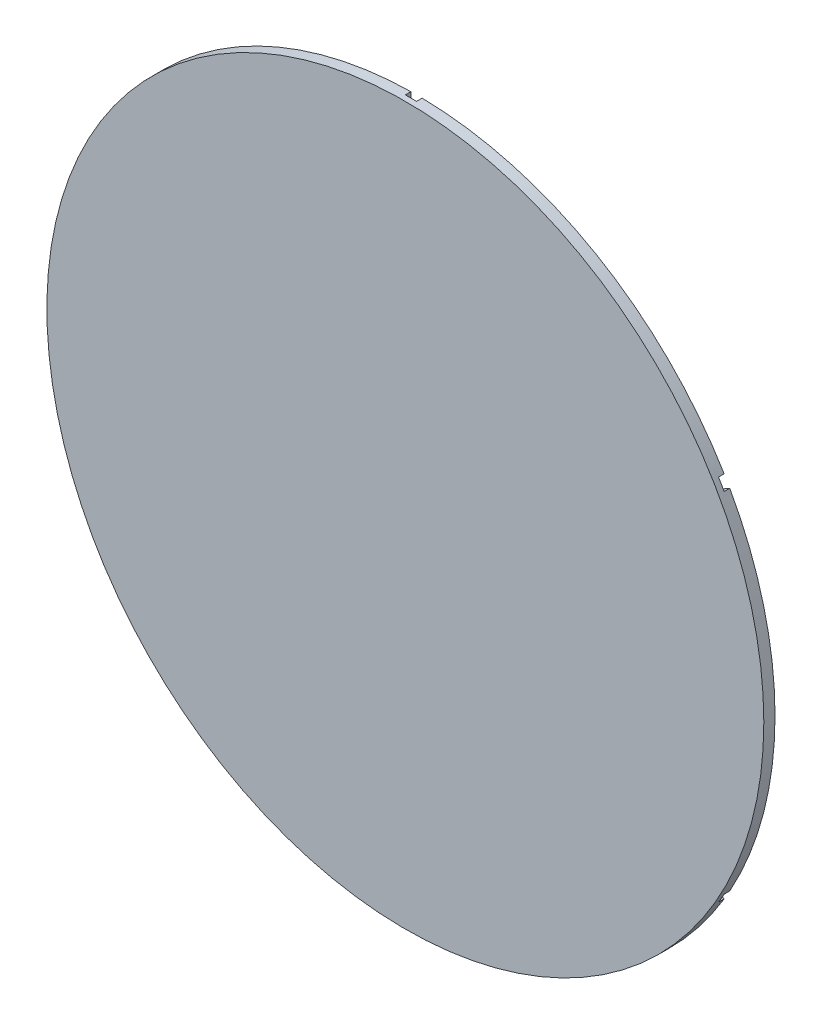
ISO-10303-21;
HEADER;
FILE_DESCRIPTION(('STEP AP214'),'2;1');
FILE_NAME('part.step','',(''),(''),'','','');
FILE_SCHEMA(('AUTOMOTIVE_DESIGN { 1 0 10303 214 1 1 1 1 }'));
ENDSEC;
DATA;
#1=APPLICATION_CONTEXT('core data for automotive mechanical design processes');
#2=APPLICATION_PROTOCOL_DEFINITION('international standard','automotive_design',2000,#1);
#3=PRODUCT_CONTEXT('',#1,'mechanical');
#4=PRODUCT('Part','Part','',(#3));
#5=PRODUCT_RELATED_PRODUCT_CATEGORY('part','',(#4));
#6=PRODUCT_DEFINITION_FORMATION('','',#4);
#7=PRODUCT_DEFINITION_CONTEXT('part definition',#1,'design');
#8=PRODUCT_DEFINITION('design','',#6,#7);
#9=PRODUCT_DEFINITION_SHAPE('','',#8);
#10=(LENGTH_UNIT() NAMED_UNIT(*) SI_UNIT(.MILLI.,.METRE.));
#11=(NAMED_UNIT(*) PLANE_ANGLE_UNIT() SI_UNIT($,.RADIAN.));
#12=(NAMED_UNIT(*) SI_UNIT($,.STERADIAN.) SOLID_ANGLE_UNIT());
#13=UNCERTAINTY_MEASURE_WITH_UNIT(LENGTH_MEASURE(1.E-05),#10,'distance_accuracy_value','');
#14=(GEOMETRIC_REPRESENTATION_CONTEXT(3) GLOBAL_UNCERTAINTY_ASSIGNED_CONTEXT((#13)) GLOBAL_UNIT_ASSIGNED_CONTEXT((#10,
#11,#12)) REPRESENTATION_CONTEXT('',''));
#15=CARTESIAN_POINT('',(0.,0.,0.));
#16=DIRECTION('',(0.,0.,1.));
#17=DIRECTION('',(1.,0.,0.));
#18=AXIS2_PLACEMENT_3D('',#15,#16,#17);
#19=CARTESIAN_POINT('',(0.,0.,3.175));
#20=DIRECTION('',(0.,0.,-1.));
#21=DIRECTION('',(-1.,0.,0.));
#22=AXIS2_PLACEMENT_3D('',#19,#20,#21);
#23=CYLINDRICAL_SURFACE('',#22,101.6);
#24=CARTESIAN_POINT('',(0.,0.,3.175));
#25=DIRECTION('',(0.,0.,1.));
#26=DIRECTION('',(1.,0.,0.));
#27=AXIS2_PLACEMENT_3D('',#24,#25,#26);
#28=CIRCLE('',#27,101.6);
#29=CARTESIAN_POINT('',(101.6,0.,3.175));
#30=VERTEX_POINT('',#29);
#31=EDGE_CURVE('E11',#30,#30,#28,.T.);
#32=ORIENTED_EDGE('',*,*,#31,.F.);
#33=EDGE_LOOP('',(#32));
#34=FACE_BOUND('',#33,.T.);
#35=DIRECTION('',(0.,0.,-1.));
#36=VECTOR('',#35,1.);
#37=CARTESIAN_POINT('',(-87.1836896241013,52.1686137780981,1.5875));
#38=LINE('',#37,#36);
#39=CARTESIAN_POINT('',(-87.1836896241013,52.1686137780981,1.5875));
#40=VERTEX_POINT('',#39);
#41=CARTESIAN_POINT('',(-87.1836896241013,52.1686137780981,0.));
#42=VERTEX_POINT('',#41);
#43=EDGE_CURVE('E111',#40,#42,#38,.T.);
#44=ORIENTED_EDGE('',*,*,#43,.F.);
#45=CARTESIAN_POINT('',(0.,0.,1.5875));
#46=DIRECTION('',(0.,0.,-1.));
#47=DIRECTION('',(-1.,0.,0.));
#48=AXIS2_PLACEMENT_3D('',#45,#46,#47);
#49=CIRCLE('',#48,101.6);
#50=CARTESIAN_POINT('',(-88.7711896241013,49.4189831210826,1.5875));
#51=VERTEX_POINT('',#50);
#52=EDGE_CURVE('E178',#51,#40,#49,.T.);
#53=ORIENTED_EDGE('',*,*,#52,.F.);
#54=DIRECTION('',(0.,0.,-1.));
#55=VECTOR('',#54,1.);
#56=CARTESIAN_POINT('',(-88.7711896241013,49.4189831210826,1.5875));
#57=LINE('',#56,#55);
#58=CARTESIAN_POINT('',(-88.7711896241013,49.4189831210826,0.));
#59=VERTEX_POINT('',#58);
#60=EDGE_CURVE('E169',#51,#59,#57,.T.);
#61=ORIENTED_EDGE('',*,*,#60,.T.);
#62=CARTESIAN_POINT('',(0.,0.,0.));
#63=DIRECTION('',(0.,0.,1.));
#64=DIRECTION('',(1.,0.,0.));
#65=AXIS2_PLACEMENT_3D('',#62,#63,#64);
#66=CIRCLE('',#65,101.6);
#67=CARTESIAN_POINT('',(-88.7711896241019,-49.4189831210815,0.));
#68=VERTEX_POINT('',#67);
#69=EDGE_CURVE('E266',#59,#68,#66,.T.);
#70=ORIENTED_EDGE('',*,*,#69,.T.);
#71=DIRECTION('',(0.,0.,-1.));
#72=VECTOR('',#71,1.);
#73=CARTESIAN_POINT('',(-88.7711896241019,-49.4189831210815,1.5875));
#74=LINE('',#73,#72);
#75=CARTESIAN_POINT('',(-88.7711896241019,-49.4189831210815,1.5875));
#76=VERTEX_POINT('',#75);
#77=EDGE_CURVE('E170',#76,#68,#74,.T.);
#78=ORIENTED_EDGE('',*,*,#77,.F.);
#79=CARTESIAN_POINT('',(0.,0.,1.5875));
#80=DIRECTION('',(0.,0.,-1.));
#81=DIRECTION('',(-1.,0.,0.));
#82=AXIS2_PLACEMENT_3D('',#79,#80,#81);
#83=CIRCLE('',#82,101.6);
#84=CARTESIAN_POINT('',(-87.1836896241019,-52.1686137780971,1.5875));
#85=VERTEX_POINT('',#84);
#86=EDGE_CURVE('E183',#85,#76,#83,.T.);
#87=ORIENTED_EDGE('',*,*,#86,.F.);
#88=DIRECTION('',(0.,0.,-1.));
#89=VECTOR('',#88,1.);
#90=CARTESIAN_POINT('',(-87.1836896241019,-52.1686137780971,1.5875));
#91=LINE('',#90,#89);
#92=CARTESIAN_POINT('',(-87.1836896241019,-52.1686137780971,0.));
#93=VERTEX_POINT('',#92);
#94=EDGE_CURVE('E223',#85,#93,#91,.T.);
#95=ORIENTED_EDGE('',*,*,#94,.T.);
#96=CARTESIAN_POINT('',(-1.5875,-101.587596899179,0.));
#97=VERTEX_POINT('',#96);
#98=EDGE_CURVE('E269',#93,#97,#66,.T.);
#99=ORIENTED_EDGE('',*,*,#98,.T.);
#100=DIRECTION('',(0.,0.,-1.));
#101=VECTOR('',#100,1.);
#102=CARTESIAN_POINT('',(-1.5875,-101.587596899179,1.5875));
#103=LINE('',#102,#101);
#104=CARTESIAN_POINT('',(-1.5875,-101.587596899179,1.5875));
#105=VERTEX_POINT('',#104);
#106=EDGE_CURVE('E228',#105,#97,#103,.T.);
#107=ORIENTED_EDGE('',*,*,#106,.F.);
#108=CARTESIAN_POINT('',(0.,0.,1.5875));
#109=DIRECTION('',(0.,0.,-1.));
#110=DIRECTION('',(-1.,0.,0.));
#111=AXIS2_PLACEMENT_3D('',#108,#109,#110);
#112=CIRCLE('',#111,101.6);
#113=CARTESIAN_POINT('',(1.5875,-101.587596899179,1.5875));
#114=VERTEX_POINT('',#113);
#115=EDGE_CURVE('E314',#114,#105,#112,.T.);
#116=ORIENTED_EDGE('',*,*,#115,.F.);
#117=DIRECTION('',(0.,0.,-1.));
#118=VECTOR('',#117,1.);
#119=CARTESIAN_POINT('',(1.5875,-101.587596899179,1.5875));
#120=LINE('',#119,#118);
#121=CARTESIAN_POINT('',(1.5875,-101.587596899179,0.));
#122=VERTEX_POINT('',#121);
#123=EDGE_CURVE('E230',#114,#122,#120,.T.);
#124=ORIENTED_EDGE('',*,*,#123,.T.);
#125=CARTESIAN_POINT('',(87.1836896241019,-52.1686137780971,0.));
#126=VERTEX_POINT('',#125);
#127=EDGE_CURVE('E272',#122,#126,#66,.T.);
#128=ORIENTED_EDGE('',*,*,#127,.T.);
#129=DIRECTION('',(0.,0.,-1.));
#130=VECTOR('',#129,1.);
#131=CARTESIAN_POINT('',(87.1836896241019,-52.1686137780971,1.5875));
#132=LINE('',#131,#130);
#133=CARTESIAN_POINT('',(87.1836896241019,-52.1686137780971,1.5875));
#134=VERTEX_POINT('',#133);
#135=EDGE_CURVE('E235',#134,#126,#132,.T.);
#136=ORIENTED_EDGE('',*,*,#135,.F.);
#137=CARTESIAN_POINT('',(0.,0.,1.5875));
#138=DIRECTION('',(0.,0.,-1.));
#139=DIRECTION('',(-1.,0.,0.));
#140=AXIS2_PLACEMENT_3D('',#137,#138,#139);
#141=CIRCLE('',#140,101.6);
#142=CARTESIAN_POINT('',(88.7711896241019,-49.4189831210815,1.5875));
#143=VERTEX_POINT('',#142);
#144=EDGE_CURVE('E306',#143,#134,#141,.T.);
#145=ORIENTED_EDGE('',*,*,#144,.F.);
#146=DIRECTION('',(0.,0.,-1.));
#147=VECTOR('',#146,1.);
#148=CARTESIAN_POINT('',(88.7711896241019,-49.4189831210815,1.5875));
#149=LINE('',#148,#147);
#150=CARTESIAN_POINT('',(88.7711896241019,-49.4189831210815,0.));
#151=VERTEX_POINT('',#150);
#152=EDGE_CURVE('E237',#143,#151,#149,.T.);
#153=ORIENTED_EDGE('',*,*,#152,.T.);
#154=CARTESIAN_POINT('',(88.7711896241013,49.4189831210826,0.));
#155=VERTEX_POINT('',#154);
#156=EDGE_CURVE('E36',#151,#155,#66,.T.);
#157=ORIENTED_EDGE('',*,*,#156,.T.);
#158=DIRECTION('',(0.,0.,-1.));
#159=VECTOR('',#158,1.);
#160=CARTESIAN_POINT('',(88.7711896241013,49.4189831210826,1.5875));
#161=LINE('',#160,#159);
#162=CARTESIAN_POINT('',(88.7711896241013,49.4189831210826,1.5875));
#163=VERTEX_POINT('',#162);
#164=EDGE_CURVE('E242',#163,#155,#161,.T.);
#165=ORIENTED_EDGE('',*,*,#164,.F.);
#166=CARTESIAN_POINT('',(0.,0.,1.5875));
#167=DIRECTION('',(0.,0.,-1.));
#168=DIRECTION('',(-1.,0.,0.));
#169=AXIS2_PLACEMENT_3D('',#166,#167,#168);
#170=CIRCLE('',#169,101.6);
#171=CARTESIAN_POINT('',(87.1836896241013,52.1686137780981,1.5875));
#172=VERTEX_POINT('',#171);
#173=EDGE_CURVE('E294',#172,#163,#170,.T.);
#174=ORIENTED_EDGE('',*,*,#173,.F.);
#175=DIRECTION('',(0.,0.,-1.));
#176=VECTOR('',#175,1.);
#177=CARTESIAN_POINT('',(87.1836896241013,52.1686137780981,1.5875));
#178=LINE('',#177,#176);
#179=CARTESIAN_POINT('',(87.1836896241013,52.1686137780981,0.));
#180=VERTEX_POINT('',#179);
#181=EDGE_CURVE('E244',#172,#180,#178,.T.);
#182=ORIENTED_EDGE('',*,*,#181,.T.);
#183=CARTESIAN_POINT('',(1.5875,101.587596899179,0.));
#184=VERTEX_POINT('',#183);
#185=EDGE_CURVE('E41',#180,#184,#66,.T.);
#186=ORIENTED_EDGE('',*,*,#185,.T.);
#187=DIRECTION('',(0.,0.,-1.));
#188=VECTOR('',#187,1.);
#189=CARTESIAN_POINT('',(1.5875,101.587596899179,1.5875));
#190=LINE('',#189,#188);
#191=CARTESIAN_POINT('',(1.5875,101.587596899179,1.5875));
#192=VERTEX_POINT('',#191);
#193=EDGE_CURVE('E249',#192,#184,#190,.T.);
#194=ORIENTED_EDGE('',*,*,#193,.F.);
#195=CARTESIAN_POINT('',(0.,0.,1.5875));
#196=DIRECTION('',(0.,0.,-1.));
#197=DIRECTION('',(-1.,0.,0.));
#198=AXIS2_PLACEMENT_3D('',#195,#196,#197);
#199=CIRCLE('',#198,101.6);
#200=CARTESIAN_POINT('',(-1.5875,101.587596899179,1.5875));
#201=VERTEX_POINT('',#200);
#202=EDGE_CURVE('E334',#201,#192,#199,.T.);
#203=ORIENTED_EDGE('',*,*,#202,.F.);
#204=DIRECTION('',(0.,0.,-1.));
#205=VECTOR('',#204,1.);
#206=CARTESIAN_POINT('',(-1.5875,101.587596899179,1.5875));
#207=LINE('',#206,#205);
#208=CARTESIAN_POINT('',(-1.5875,101.587596899179,0.));
#209=VERTEX_POINT('',#208);
#210=EDGE_CURVE('E251',#201,#209,#207,.T.);
#211=ORIENTED_EDGE('',*,*,#210,.T.);
#212=EDGE_CURVE('E264',#209,#42,#66,.T.);
#213=ORIENTED_EDGE('',*,*,#212,.T.);
#214=EDGE_LOOP('',(#44,#53,#61,#70,#78,#87,#95,#99,#107,#116,#124,#128,#136,#145,#153,#157,#165,
#174,#182,#186,#194,#203,#211,#213));
#215=FACE_BOUND('',#214,.T.);
#216=ADVANCED_FACE('F33',(#34,#215),#23,.T.);
#217=CARTESIAN_POINT('',(0.,0.,0.));
#218=DIRECTION('',(0.,0.,1.));
#219=DIRECTION('',(1.,0.,0.));
#220=AXIS2_PLACEMENT_3D('',#217,#218,#219);
#221=PLANE('',#220);
#222=DIRECTION('',(0.866025403784436,0.500000000000005,0.));
#223=VECTOR('',#222,1.);
#224=CARTESIAN_POINT('',(0.793749999999706,-1.37481532850727,0.));
#225=LINE('',#224,#223);
#226=CARTESIAN_POINT('',(-1.5875,-2.74963065701491,0.));
#227=VERTEX_POINT('',#226);
#228=EDGE_CURVE('E214',#93,#227,#225,.T.);
#229=ORIENTED_EDGE('',*,*,#228,.T.);
#230=DIRECTION('',(0.,1.,0.));
#231=VECTOR('',#230,1.);
#232=CARTESIAN_POINT('',(-1.5875,0.,0.));
#233=LINE('',#232,#231);
#234=EDGE_CURVE('E211',#97,#227,#233,.T.);
#235=ORIENTED_EDGE('',*,*,#234,.F.);
#236=ORIENTED_EDGE('',*,*,#98,.F.);
#237=EDGE_LOOP('',(#229,#235,#236));
#238=FACE_BOUND('',#237,.T.);
#239=ADVANCED_FACE('F328',(#238),#221,.F.);
#240=DIRECTION('',(0.,1.,0.));
#241=VECTOR('',#240,1.);
#242=CARTESIAN_POINT('',(1.5875,0.,0.));
#243=LINE('',#242,#241);
#244=CARTESIAN_POINT('',(1.5875,-2.74963065701491,0.));
#245=VERTEX_POINT('',#244);
#246=EDGE_CURVE('E208',#122,#245,#243,.T.);
#247=ORIENTED_EDGE('',*,*,#246,.T.);
#248=DIRECTION('',(-0.866025403784436,0.500000000000005,0.));
#249=VECTOR('',#248,1.);
#250=CARTESIAN_POINT('',(-0.793749999999706,-1.37481532850727,0.));
#251=LINE('',#250,#249);
#252=EDGE_CURVE('E205',#126,#245,#251,.T.);
#253=ORIENTED_EDGE('',*,*,#252,.F.);
#254=ORIENTED_EDGE('',*,*,#127,.F.);
#255=EDGE_LOOP('',(#247,#253,#254));
#256=FACE_BOUND('',#255,.T.);
#257=ADVANCED_FACE('F361',(#256),#221,.F.);
#258=DIRECTION('',(-0.866025403784436,0.500000000000005,0.));
#259=VECTOR('',#258,1.);
#260=CARTESIAN_POINT('',(0.793750000000313,1.37481532850832,0.));
#261=LINE('',#260,#259);
#262=CARTESIAN_POINT('',(3.17499999999997,7.01045124729127E-13,0.));
#263=VERTEX_POINT('',#262);
#264=EDGE_CURVE('E202',#151,#263,#261,.T.);
#265=ORIENTED_EDGE('',*,*,#264,.T.);
#266=DIRECTION('',(0.866025403784436,0.500000000000005,0.));
#267=VECTOR('',#266,1.);
#268=CARTESIAN_POINT('',(0.793749999999706,-1.37481532850727,0.));
#269=LINE('',#268,#267);
#270=EDGE_CURVE('E199',#263,#155,#269,.T.);
#271=ORIENTED_EDGE('',*,*,#270,.T.);
#272=ORIENTED_EDGE('',*,*,#156,.F.);
#273=EDGE_LOOP('',(#265,#271,#272));
#274=FACE_BOUND('',#273,.T.);
#275=ADVANCED_FACE('F284',(#274),#221,.F.);
#276=ORIENTED_EDGE('',*,*,#69,.F.);
#277=DIRECTION('',(-0.866025403784436,0.500000000000005,0.));
#278=VECTOR('',#277,1.);
#279=CARTESIAN_POINT('',(-0.793749999999706,-1.37481532850727,0.));
#280=LINE('',#279,#278);
#281=CARTESIAN_POINT('',(-3.17499999999997,7.01153544946376E-13,0.));
#282=VERTEX_POINT('',#281);
#283=EDGE_CURVE('E218',#282,#59,#280,.T.);
#284=ORIENTED_EDGE('',*,*,#283,.F.);
#285=DIRECTION('',(0.866025403784436,0.500000000000005,0.));
#286=VECTOR('',#285,1.);
#287=CARTESIAN_POINT('',(-0.793750000000313,1.37481532850832,0.));
#288=LINE('',#287,#286);
#289=EDGE_CURVE('E166',#68,#282,#288,.T.);
#290=ORIENTED_EDGE('',*,*,#289,.F.);
#291=EDGE_LOOP('',(#276,#284,#290));
#292=FACE_BOUND('',#291,.T.);
#293=ADVANCED_FACE('F330',(#292),#221,.F.);
#294=DIRECTION('',(-0.866025403784436,0.500000000000005,0.));
#295=VECTOR('',#294,1.);
#296=CARTESIAN_POINT('',(0.793750000000313,1.37481532850832,0.));
#297=LINE('',#296,#295);
#298=CARTESIAN_POINT('',(-1.5875,2.74963065701632,0.));
#299=VERTEX_POINT('',#298);
#300=EDGE_CURVE('E48',#299,#42,#297,.T.);
#301=ORIENTED_EDGE('',*,*,#300,.T.);
#302=ORIENTED_EDGE('',*,*,#212,.F.);
#303=DIRECTION('',(0.,1.,0.));
#304=VECTOR('',#303,1.);
#305=CARTESIAN_POINT('',(-1.5875,0.,0.));
#306=LINE('',#305,#304);
#307=EDGE_CURVE('E192',#299,#209,#306,.T.);
#308=ORIENTED_EDGE('',*,*,#307,.F.);
#309=EDGE_LOOP('',(#301,#302,#308));
#310=FACE_BOUND('',#309,.T.);
#311=ADVANCED_FACE('F262',(#310),#221,.F.);
#312=CARTESIAN_POINT('',(0.,0.,3.175));
#313=DIRECTION('',(0.,0.,1.));
#314=DIRECTION('',(1.,0.,0.));
#315=AXIS2_PLACEMENT_3D('',#312,#313,#314);
#316=PLANE('',#315);
#317=ORIENTED_EDGE('',*,*,#31,.T.);
#318=EDGE_LOOP('',(#317));
#319=FACE_BOUND('',#318,.T.);
#320=ADVANCED_FACE('F364',(#319),#316,.T.);
#321=ORIENTED_EDGE('',*,*,#185,.F.);
#322=DIRECTION('',(0.866025403784436,0.500000000000005,0.));
#323=VECTOR('',#322,1.);
#324=CARTESIAN_POINT('',(-0.793750000000313,1.37481532850832,0.));
#325=LINE('',#324,#323);
#326=CARTESIAN_POINT('',(1.5875,2.74963065701632,0.));
#327=VERTEX_POINT('',#326);
#328=EDGE_CURVE('E197',#327,#180,#325,.T.);
#329=ORIENTED_EDGE('',*,*,#328,.F.);
#330=DIRECTION('',(0.,1.,0.));
#331=VECTOR('',#330,1.);
#332=CARTESIAN_POINT('',(1.5875,0.,0.));
#333=LINE('',#332,#331);
#334=EDGE_CURVE('E194',#327,#184,#333,.T.);
#335=ORIENTED_EDGE('',*,*,#334,.T.);
#336=EDGE_LOOP('',(#321,#329,#335));
#337=FACE_BOUND('',#336,.T.);
#338=ADVANCED_FACE('F344',(#337),#221,.F.);
#339=CARTESIAN_POINT('',(0.793750000000313,1.37481532850832,1.5875));
#340=DIRECTION('',(-0.500000000000005,-0.866025403784436,0.));
#341=DIRECTION('',(0.866025403784436,-0.500000000000005,0.));
#342=AXIS2_PLACEMENT_3D('',#339,#340,#341);
#343=PLANE('',#342);
#344=ORIENTED_EDGE('',*,*,#300,.F.);
#345=DIRECTION('',(0.,0.,-1.));
#346=VECTOR('',#345,1.);
#347=CARTESIAN_POINT('',(-1.5875,2.74963065701632,1.5875));
#348=LINE('',#347,#346);
#349=CARTESIAN_POINT('',(-1.5875,2.74963065701632,1.5875));
#350=VERTEX_POINT('',#349);
#351=EDGE_CURVE('E114',#350,#299,#348,.T.);
#352=ORIENTED_EDGE('',*,*,#351,.F.);
#353=DIRECTION('',(-0.866025403784436,0.500000000000005,0.));
#354=VECTOR('',#353,1.);
#355=CARTESIAN_POINT('',(0.793750000000313,1.37481532850832,1.5875));
#356=LINE('',#355,#354);
#357=EDGE_CURVE('E54',#350,#40,#356,.T.);
#358=ORIENTED_EDGE('',*,*,#357,.T.);
#359=ORIENTED_EDGE('',*,*,#43,.T.);
#360=EDGE_LOOP('',(#344,#352,#358,#359));
#361=FACE_BOUND('',#360,.T.);
#362=ADVANCED_FACE('F371',(#361),#343,.T.);
#363=CARTESIAN_POINT('',(-0.793749999999706,-1.37481532850727,1.5875));
#364=DIRECTION('',(-0.500000000000005,-0.866025403784436,0.));
#365=DIRECTION('',(0.866025403784436,-0.500000000000005,0.));
#366=AXIS2_PLACEMENT_3D('',#363,#364,#365);
#367=PLANE('',#366);
#368=ORIENTED_EDGE('',*,*,#283,.T.);
#369=ORIENTED_EDGE('',*,*,#60,.F.);
#370=DIRECTION('',(-0.866025403784436,0.500000000000005,0.));
#371=VECTOR('',#370,1.);
#372=CARTESIAN_POINT('',(-0.793749999999706,-1.37481532850727,1.5875));
#373=LINE('',#372,#371);
#374=CARTESIAN_POINT('',(-3.17499999999997,7.01153544946376E-13,1.5875));
#375=VERTEX_POINT('',#374);
#376=EDGE_CURVE('E173',#375,#51,#373,.T.);
#377=ORIENTED_EDGE('',*,*,#376,.F.);
#378=DIRECTION('',(0.,0.,-1.));
#379=VECTOR('',#378,1.);
#380=CARTESIAN_POINT('',(-3.17499999999997,7.01153544946376E-13,1.5875));
#381=LINE('',#380,#379);
#382=EDGE_CURVE('E159',#375,#282,#381,.T.);
#383=ORIENTED_EDGE('',*,*,#382,.T.);
#384=EDGE_LOOP('',(#368,#369,#377,#383));
#385=FACE_BOUND('',#384,.T.);
#386=ADVANCED_FACE('F174',(#385),#367,.F.);
#387=CARTESIAN_POINT('',(-0.793750000000313,1.37481532850832,1.5875));
#388=DIRECTION('',(-0.500000000000005,0.866025403784436,0.));
#389=DIRECTION('',(-0.866025403784436,-0.500000000000005,0.));
#390=AXIS2_PLACEMENT_3D('',#387,#388,#389);
#391=PLANE('',#390);
#392=ORIENTED_EDGE('',*,*,#289,.T.);
#393=ORIENTED_EDGE('',*,*,#382,.F.);
#394=DIRECTION('',(0.866025403784436,0.500000000000005,0.));
#395=VECTOR('',#394,1.);
#396=CARTESIAN_POINT('',(-0.793750000000313,1.37481532850832,1.5875));
#397=LINE('',#396,#395);
#398=EDGE_CURVE('E163',#76,#375,#397,.T.);
#399=ORIENTED_EDGE('',*,*,#398,.F.);
#400=ORIENTED_EDGE('',*,*,#77,.T.);
#401=EDGE_LOOP('',(#392,#393,#399,#400));
#402=FACE_BOUND('',#401,.T.);
#403=ADVANCED_FACE('F161',(#402),#391,.F.);
#404=CARTESIAN_POINT('',(0.793749999999706,-1.37481532850727,1.5875));
#405=DIRECTION('',(-0.500000000000005,0.866025403784436,0.));
#406=DIRECTION('',(-0.866025403784436,-0.500000000000005,0.));
#407=AXIS2_PLACEMENT_3D('',#404,#405,#406);
#408=PLANE('',#407);
#409=ORIENTED_EDGE('',*,*,#228,.F.);
#410=ORIENTED_EDGE('',*,*,#94,.F.);
#411=DIRECTION('',(0.866025403784436,0.500000000000005,0.));
#412=VECTOR('',#411,1.);
#413=CARTESIAN_POINT('',(0.793749999999706,-1.37481532850727,1.5875));
#414=LINE('',#413,#412);
#415=CARTESIAN_POINT('',(-1.5875,-2.74963065701491,1.5875));
#416=VERTEX_POINT('',#415);
#417=EDGE_CURVE('E186',#85,#416,#414,.T.);
#418=ORIENTED_EDGE('',*,*,#417,.T.);
#419=DIRECTION('',(0.,0.,-1.));
#420=VECTOR('',#419,1.);
#421=CARTESIAN_POINT('',(-1.5875,-2.74963065701491,1.5875));
#422=LINE('',#421,#420);
#423=EDGE_CURVE('E226',#416,#227,#422,.T.);
#424=ORIENTED_EDGE('',*,*,#423,.T.);
#425=EDGE_LOOP('',(#409,#410,#418,#424));
#426=FACE_BOUND('',#425,.T.);
#427=ADVANCED_FACE('F321',(#426),#408,.T.);
#428=CARTESIAN_POINT('',(-1.5875,0.,1.5875));
#429=DIRECTION('',(-1.,0.,0.));
#430=DIRECTION('',(0.,0.,1.));
#431=AXIS2_PLACEMENT_3D('',#428,#429,#430);
#432=PLANE('',#431);
#433=ORIENTED_EDGE('',*,*,#234,.T.);
#434=ORIENTED_EDGE('',*,*,#423,.F.);
#435=DIRECTION('',(0.,1.,0.));
#436=VECTOR('',#435,1.);
#437=CARTESIAN_POINT('',(-1.5875,0.,1.5875));
#438=LINE('',#437,#436);
#439=EDGE_CURVE('E317',#105,#416,#438,.T.);
#440=ORIENTED_EDGE('',*,*,#439,.F.);
#441=ORIENTED_EDGE('',*,*,#106,.T.);
#442=EDGE_LOOP('',(#433,#434,#440,#441));
#443=FACE_BOUND('',#442,.T.);
#444=ADVANCED_FACE('F323',(#443),#432,.F.);
#445=CARTESIAN_POINT('',(1.5875,0.,1.5875));
#446=DIRECTION('',(-1.,0.,0.));
#447=DIRECTION('',(0.,0.,1.));
#448=AXIS2_PLACEMENT_3D('',#445,#446,#447);
#449=PLANE('',#448);
#450=ORIENTED_EDGE('',*,*,#246,.F.);
#451=ORIENTED_EDGE('',*,*,#123,.F.);
#452=DIRECTION('',(0.,1.,0.));
#453=VECTOR('',#452,1.);
#454=CARTESIAN_POINT('',(1.5875,0.,1.5875));
#455=LINE('',#454,#453);
#456=CARTESIAN_POINT('',(1.5875,-2.74963065701491,1.5875));
#457=VERTEX_POINT('',#456);
#458=EDGE_CURVE('E312',#114,#457,#455,.T.);
#459=ORIENTED_EDGE('',*,*,#458,.T.);
#460=DIRECTION('',(0.,0.,-1.));
#461=VECTOR('',#460,1.);
#462=CARTESIAN_POINT('',(1.5875,-2.74963065701491,1.5875));
#463=LINE('',#462,#461);
#464=EDGE_CURVE('E233',#457,#245,#463,.T.);
#465=ORIENTED_EDGE('',*,*,#464,.T.);
#466=EDGE_LOOP('',(#450,#451,#459,#465));
#467=FACE_BOUND('',#466,.T.);
#468=ADVANCED_FACE('F391',(#467),#449,.T.);
#469=CARTESIAN_POINT('',(-0.793749999999706,-1.37481532850727,1.5875));
#470=DIRECTION('',(-0.500000000000005,-0.866025403784436,0.));
#471=DIRECTION('',(0.866025403784436,-0.500000000000005,0.));
#472=AXIS2_PLACEMENT_3D('',#469,#470,#471);
#473=PLANE('',#472);
#474=ORIENTED_EDGE('',*,*,#252,.T.);
#475=ORIENTED_EDGE('',*,*,#464,.F.);
#476=DIRECTION('',(-0.866025403784436,0.500000000000005,0.));
#477=VECTOR('',#476,1.);
#478=CARTESIAN_POINT('',(-0.793749999999706,-1.37481532850727,1.5875));
#479=LINE('',#478,#477);
#480=EDGE_CURVE('E309',#134,#457,#479,.T.);
#481=ORIENTED_EDGE('',*,*,#480,.F.);
#482=ORIENTED_EDGE('',*,*,#135,.T.);
#483=EDGE_LOOP('',(#474,#475,#481,#482));
#484=FACE_BOUND('',#483,.T.);
#485=ADVANCED_FACE('F394',(#484),#473,.F.);
#486=CARTESIAN_POINT('',(0.793750000000313,1.37481532850832,1.5875));
#487=DIRECTION('',(-0.500000000000005,-0.866025403784436,0.));
#488=DIRECTION('',(0.866025403784436,-0.500000000000005,0.));
#489=AXIS2_PLACEMENT_3D('',#486,#487,#488);
#490=PLANE('',#489);
#491=ORIENTED_EDGE('',*,*,#264,.F.);
#492=ORIENTED_EDGE('',*,*,#152,.F.);
#493=DIRECTION('',(-0.866025403784436,0.500000000000005,0.));
#494=VECTOR('',#493,1.);
#495=CARTESIAN_POINT('',(0.793750000000313,1.37481532850832,1.5875));
#496=LINE('',#495,#494);
#497=CARTESIAN_POINT('',(3.17499999999997,7.01045124729127E-13,1.5875));
#498=VERTEX_POINT('',#497);
#499=EDGE_CURVE('E293',#143,#498,#496,.T.);
#500=ORIENTED_EDGE('',*,*,#499,.T.);
#501=DIRECTION('',(0.,0.,-1.));
#502=VECTOR('',#501,1.);
#503=CARTESIAN_POINT('',(3.17499999999997,7.01045124729127E-13,1.5875));
#504=LINE('',#503,#502);
#505=EDGE_CURVE('E240',#498,#263,#504,.T.);
#506=ORIENTED_EDGE('',*,*,#505,.T.);
#507=EDGE_LOOP('',(#491,#492,#500,#506));
#508=FACE_BOUND('',#507,.T.);
#509=ADVANCED_FACE('F354',(#508),#490,.T.);
#510=CARTESIAN_POINT('',(0.793749999999706,-1.37481532850727,1.5875));
#511=DIRECTION('',(-0.500000000000005,0.866025403784436,0.));
#512=DIRECTION('',(-0.866025403784436,-0.500000000000005,0.));
#513=AXIS2_PLACEMENT_3D('',#510,#511,#512);
#514=PLANE('',#513);
#515=ORIENTED_EDGE('',*,*,#270,.F.);
#516=ORIENTED_EDGE('',*,*,#505,.F.);
#517=DIRECTION('',(0.866025403784436,0.500000000000005,0.));
#518=VECTOR('',#517,1.);
#519=CARTESIAN_POINT('',(0.793749999999706,-1.37481532850727,1.5875));
#520=LINE('',#519,#518);
#521=EDGE_CURVE('E290',#498,#163,#520,.T.);
#522=ORIENTED_EDGE('',*,*,#521,.T.);
#523=ORIENTED_EDGE('',*,*,#164,.T.);
#524=EDGE_LOOP('',(#515,#516,#522,#523));
#525=FACE_BOUND('',#524,.T.);
#526=ADVANCED_FACE('F288',(#525),#514,.T.);
#527=CARTESIAN_POINT('',(-0.793750000000313,1.37481532850832,1.5875));
#528=DIRECTION('',(-0.500000000000005,0.866025403784436,0.));
#529=DIRECTION('',(-0.866025403784436,-0.500000000000005,0.));
#530=AXIS2_PLACEMENT_3D('',#527,#528,#529);
#531=PLANE('',#530);
#532=ORIENTED_EDGE('',*,*,#328,.T.);
#533=ORIENTED_EDGE('',*,*,#181,.F.);
#534=DIRECTION('',(0.866025403784436,0.500000000000005,0.));
#535=VECTOR('',#534,1.);
#536=CARTESIAN_POINT('',(-0.793750000000313,1.37481532850832,1.5875));
#537=LINE('',#536,#535);
#538=CARTESIAN_POINT('',(1.5875,2.74963065701632,1.5875));
#539=VERTEX_POINT('',#538);
#540=EDGE_CURVE('E299',#539,#172,#537,.T.);
#541=ORIENTED_EDGE('',*,*,#540,.F.);
#542=DIRECTION('',(0.,0.,-1.));
#543=VECTOR('',#542,1.);
#544=CARTESIAN_POINT('',(1.5875,2.74963065701632,1.5875));
#545=LINE('',#544,#543);
#546=EDGE_CURVE('E247',#539,#327,#545,.T.);
#547=ORIENTED_EDGE('',*,*,#546,.T.);
#548=EDGE_LOOP('',(#532,#533,#541,#547));
#549=FACE_BOUND('',#548,.T.);
#550=ADVANCED_FACE('F346',(#549),#531,.F.);
#551=CARTESIAN_POINT('',(1.5875,0.,1.5875));
#552=DIRECTION('',(-1.,0.,0.));
#553=DIRECTION('',(0.,0.,1.));
#554=AXIS2_PLACEMENT_3D('',#551,#552,#553);
#555=PLANE('',#554);
#556=ORIENTED_EDGE('',*,*,#334,.F.);
#557=ORIENTED_EDGE('',*,*,#546,.F.);
#558=DIRECTION('',(0.,1.,0.));
#559=VECTOR('',#558,1.);
#560=CARTESIAN_POINT('',(1.5875,0.,1.5875));
#561=LINE('',#560,#559);
#562=EDGE_CURVE('E301',#539,#192,#561,.T.);
#563=ORIENTED_EDGE('',*,*,#562,.T.);
#564=ORIENTED_EDGE('',*,*,#193,.T.);
#565=EDGE_LOOP('',(#556,#557,#563,#564));
#566=FACE_BOUND('',#565,.T.);
#567=ADVANCED_FACE('F339',(#566),#555,.T.);
#568=CARTESIAN_POINT('',(-1.5875,0.,1.5875));
#569=DIRECTION('',(-1.,0.,0.));
#570=DIRECTION('',(0.,0.,1.));
#571=AXIS2_PLACEMENT_3D('',#568,#569,#570);
#572=PLANE('',#571);
#573=ORIENTED_EDGE('',*,*,#307,.T.);
#574=ORIENTED_EDGE('',*,*,#210,.F.);
#575=DIRECTION('',(0.,1.,0.));
#576=VECTOR('',#575,1.);
#577=CARTESIAN_POINT('',(-1.5875,0.,1.5875));
#578=LINE('',#577,#576);
#579=EDGE_CURVE('E259',#350,#201,#578,.T.);
#580=ORIENTED_EDGE('',*,*,#579,.F.);
#581=ORIENTED_EDGE('',*,*,#351,.T.);
#582=EDGE_LOOP('',(#573,#574,#580,#581));
#583=FACE_BOUND('',#582,.T.);
#584=ADVANCED_FACE('F257',(#583),#572,.F.);
#585=CARTESIAN_POINT('',(0.,0.,1.5875));
#586=DIRECTION('',(0.,0.,-1.));
#587=DIRECTION('',(-1.,0.,0.));
#588=AXIS2_PLACEMENT_3D('',#585,#586,#587);
#589=PLANE('',#588);
#590=ORIENTED_EDGE('',*,*,#357,.F.);
#591=ORIENTED_EDGE('',*,*,#579,.T.);
#592=ORIENTED_EDGE('',*,*,#202,.T.);
#593=ORIENTED_EDGE('',*,*,#562,.F.);
#594=ORIENTED_EDGE('',*,*,#540,.T.);
#595=ORIENTED_EDGE('',*,*,#173,.T.);
#596=ORIENTED_EDGE('',*,*,#521,.F.);
#597=ORIENTED_EDGE('',*,*,#499,.F.);
#598=ORIENTED_EDGE('',*,*,#144,.T.);
#599=ORIENTED_EDGE('',*,*,#480,.T.);
#600=ORIENTED_EDGE('',*,*,#458,.F.);
#601=ORIENTED_EDGE('',*,*,#115,.T.);
#602=ORIENTED_EDGE('',*,*,#439,.T.);
#603=ORIENTED_EDGE('',*,*,#417,.F.);
#604=ORIENTED_EDGE('',*,*,#86,.T.);
#605=ORIENTED_EDGE('',*,*,#398,.T.);
#606=ORIENTED_EDGE('',*,*,#376,.T.);
#607=ORIENTED_EDGE('',*,*,#52,.T.);
#608=EDGE_LOOP('',(#590,#591,#592,#593,#594,#595,#596,#597,#598,#599,#600,#601,#602,#603,#604,
#605,#606,#607));
#609=FACE_BOUND('',#608,.T.);
#610=ADVANCED_FACE('F180',(#609),#589,.T.);
#611=CLOSED_SHELL('',(#216,#239,#257,#275,#293,#311,#320,#338,#362,#386,#403,#427,#444,#468,
#485,#509,#526,#550,#567,#584,#610));
#612=MANIFOLD_SOLID_BREP('B2',#611);
#613=ADVANCED_BREP_SHAPE_REPRESENTATION('',(#18,#612),#14);
#614=SHAPE_DEFINITION_REPRESENTATION(#9,#613);
ENDSEC;
END-ISO-10303-21;
